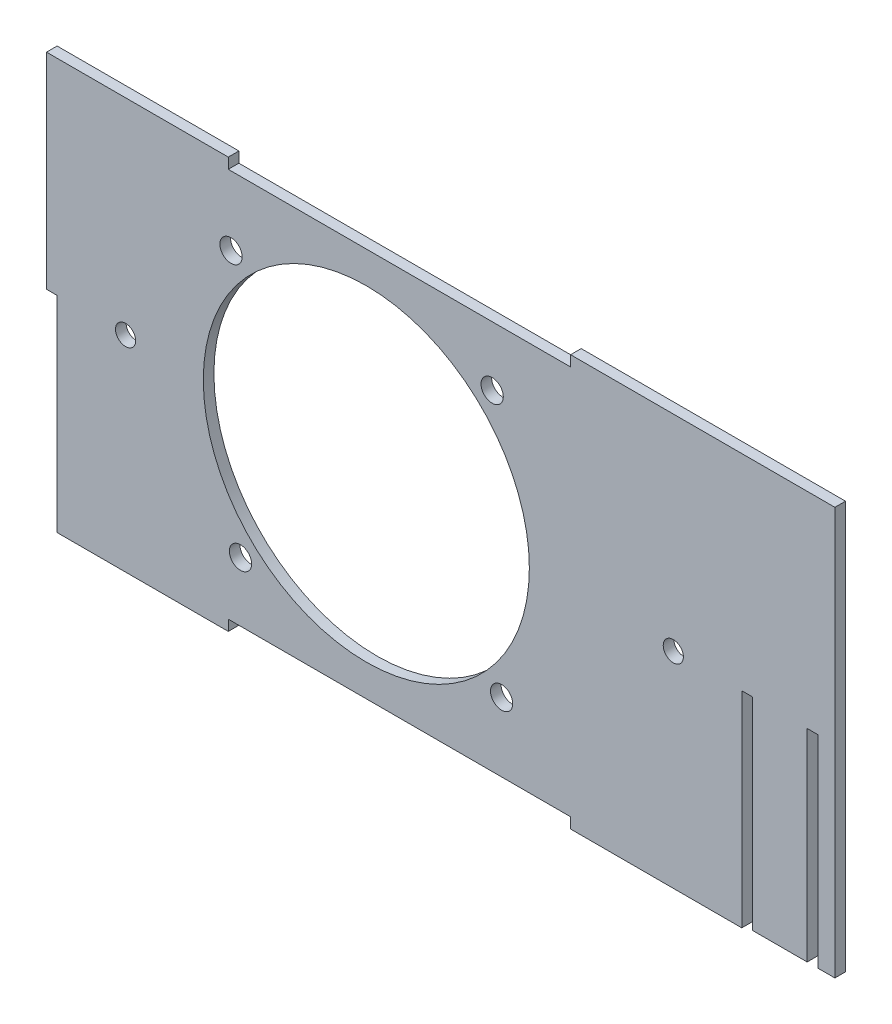
ISO-10303-21;
HEADER;
FILE_DESCRIPTION(('STEP AP214'),'2;1');
FILE_NAME('part.step','',(''),(''),'','','');
FILE_SCHEMA(('AUTOMOTIVE_DESIGN { 1 0 10303 214 1 1 1 1 }'));
ENDSEC;
DATA;
#1=APPLICATION_CONTEXT('core data for automotive mechanical design processes');
#2=APPLICATION_PROTOCOL_DEFINITION('international standard','automotive_design',2000,#1);
#3=PRODUCT_CONTEXT('',#1,'mechanical');
#4=PRODUCT('Part','Part','',(#3));
#5=PRODUCT_RELATED_PRODUCT_CATEGORY('part','',(#4));
#6=PRODUCT_DEFINITION_FORMATION('','',#4);
#7=PRODUCT_DEFINITION_CONTEXT('part definition',#1,'design');
#8=PRODUCT_DEFINITION('design','',#6,#7);
#9=PRODUCT_DEFINITION_SHAPE('','',#8);
#10=(LENGTH_UNIT() NAMED_UNIT(*) SI_UNIT(.MILLI.,.METRE.));
#11=(NAMED_UNIT(*) PLANE_ANGLE_UNIT() SI_UNIT($,.RADIAN.));
#12=(NAMED_UNIT(*) SI_UNIT($,.STERADIAN.) SOLID_ANGLE_UNIT());
#13=UNCERTAINTY_MEASURE_WITH_UNIT(LENGTH_MEASURE(1.E-05),#10,'distance_accuracy_value','');
#14=(GEOMETRIC_REPRESENTATION_CONTEXT(3) GLOBAL_UNCERTAINTY_ASSIGNED_CONTEXT((#13)) GLOBAL_UNIT_ASSIGNED_CONTEXT((#10,
#11,#12)) REPRESENTATION_CONTEXT('',''));
#15=CARTESIAN_POINT('',(0.,0.,0.));
#16=DIRECTION('',(0.,0.,1.));
#17=DIRECTION('',(1.,0.,0.));
#18=AXIS2_PLACEMENT_3D('',#15,#16,#17);
#19=CARTESIAN_POINT('',(109.675,60.,3.1));
#20=DIRECTION('',(0.,-1.,0.));
#21=DIRECTION('',(1.,0.,0.));
#22=AXIS2_PLACEMENT_3D('',#19,#20,#21);
#23=PLANE('',#22);
#24=DIRECTION('',(-1.,0.,0.));
#25=VECTOR('',#24,1.);
#26=CARTESIAN_POINT('',(109.675,60.,3.1));
#27=LINE('',#26,#25);
#28=CARTESIAN_POINT('',(-40.3250000000002,59.9999999999998,3.1));
#29=VERTEX_POINT('',#28);
#30=CARTESIAN_POINT('',(-93.425,60.,3.1));
#31=VERTEX_POINT('',#30);
#32=EDGE_CURVE('E327',#29,#31,#27,.T.);
#33=ORIENTED_EDGE('',*,*,#32,.F.);
#34=DIRECTION('',(0.,0.,-1.));
#35=VECTOR('',#34,1.);
#36=CARTESIAN_POINT('',(-40.3250000000003,60.,3.1));
#37=LINE('',#36,#35);
#38=CARTESIAN_POINT('',(-40.3250000000002,59.9999999999998,0.));
#39=VERTEX_POINT('',#38);
#40=EDGE_CURVE('E41',#29,#39,#37,.T.);
#41=ORIENTED_EDGE('',*,*,#40,.T.);
#42=DIRECTION('',(-1.,0.,0.));
#43=VECTOR('',#42,1.);
#44=CARTESIAN_POINT('',(109.675,60.,0.));
#45=LINE('',#44,#43);
#46=CARTESIAN_POINT('',(-93.425,60.,0.));
#47=VERTEX_POINT('',#46);
#48=EDGE_CURVE('E325',#39,#47,#45,.T.);
#49=ORIENTED_EDGE('',*,*,#48,.T.);
#50=DIRECTION('',(0.,0.,1.));
#51=VECTOR('',#50,1.);
#52=CARTESIAN_POINT('',(-93.425,60.,0.));
#53=LINE('',#52,#51);
#54=EDGE_CURVE('E433',#47,#31,#53,.T.);
#55=ORIENTED_EDGE('',*,*,#54,.T.);
#56=EDGE_LOOP('',(#33,#41,#49,#55));
#57=FACE_BOUND('',#56,.T.);
#58=ADVANCED_FACE('F32',(#57),#23,.F.);
#59=CARTESIAN_POINT('',(109.675,-60.,3.1));
#60=DIRECTION('',(0.,1.,0.));
#61=DIRECTION('',(-1.,0.,0.));
#62=AXIS2_PLACEMENT_3D('',#59,#60,#61);
#63=PLANE('',#62);
#64=DIRECTION('',(1.,0.,0.));
#65=VECTOR('',#64,1.);
#66=CARTESIAN_POINT('',(109.675,-60.,3.1));
#67=LINE('',#66,#65);
#68=CARTESIAN_POINT('',(59.675,-60.,3.1));
#69=VERTEX_POINT('',#68);
#70=CARTESIAN_POINT('',(109.675,-60.,3.1));
#71=VERTEX_POINT('',#70);
#72=EDGE_CURVE('E386',#69,#71,#67,.T.);
#73=ORIENTED_EDGE('',*,*,#72,.F.);
#74=DIRECTION('',(0.,0.,-1.));
#75=VECTOR('',#74,1.);
#76=CARTESIAN_POINT('',(59.675,-60.,3.1));
#77=LINE('',#76,#75);
#78=CARTESIAN_POINT('',(59.675,-60.,0.));
#79=VERTEX_POINT('',#78);
#80=EDGE_CURVE('E311',#69,#79,#77,.T.);
#81=ORIENTED_EDGE('',*,*,#80,.T.);
#82=DIRECTION('',(1.,0.,0.));
#83=VECTOR('',#82,1.);
#84=CARTESIAN_POINT('',(109.675,-60.,0.));
#85=LINE('',#84,#83);
#86=CARTESIAN_POINT('',(109.675,-60.,0.));
#87=VERTEX_POINT('',#86);
#88=EDGE_CURVE('E356',#79,#87,#85,.T.);
#89=ORIENTED_EDGE('',*,*,#88,.T.);
#90=DIRECTION('',(0.,0.,-1.));
#91=VECTOR('',#90,1.);
#92=CARTESIAN_POINT('',(109.675,-60.,3.1));
#93=LINE('',#92,#91);
#94=EDGE_CURVE('E347',#71,#87,#93,.T.);
#95=ORIENTED_EDGE('',*,*,#94,.F.);
#96=EDGE_LOOP('',(#73,#81,#89,#95));
#97=FACE_BOUND('',#96,.T.);
#98=ADVANCED_FACE('F370',(#97),#63,.F.);
#99=CARTESIAN_POINT('',(-90.325,-60.,3.1));
#100=DIRECTION('',(1.,0.,0.));
#101=DIRECTION('',(0.,0.,-1.));
#102=AXIS2_PLACEMENT_3D('',#99,#100,#101);
#103=PLANE('',#102);
#104=DIRECTION('',(0.,0.,1.));
#105=VECTOR('',#104,1.);
#106=CARTESIAN_POINT('',(-90.325,0.,0.));
#107=LINE('',#106,#105);
#108=CARTESIAN_POINT('',(-90.325,0.,0.));
#109=VERTEX_POINT('',#108);
#110=CARTESIAN_POINT('',(-90.325,0.,3.1));
#111=VERTEX_POINT('',#110);
#112=EDGE_CURVE('E435',#109,#111,#107,.T.);
#113=ORIENTED_EDGE('',*,*,#112,.F.);
#114=DIRECTION('',(0.,-1.,0.));
#115=VECTOR('',#114,1.);
#116=CARTESIAN_POINT('',(-90.325,-60.,0.));
#117=LINE('',#116,#115);
#118=CARTESIAN_POINT('',(-90.325,-60.,0.));
#119=VERTEX_POINT('',#118);
#120=EDGE_CURVE('E353',#109,#119,#117,.T.);
#121=ORIENTED_EDGE('',*,*,#120,.T.);
#122=DIRECTION('',(0.,0.,-1.));
#123=VECTOR('',#122,1.);
#124=CARTESIAN_POINT('',(-90.325,-60.,3.1));
#125=LINE('',#124,#123);
#126=CARTESIAN_POINT('',(-90.325,-60.,3.1));
#127=VERTEX_POINT('',#126);
#128=EDGE_CURVE('E312',#127,#119,#125,.T.);
#129=ORIENTED_EDGE('',*,*,#128,.F.);
#130=DIRECTION('',(0.,-1.,0.));
#131=VECTOR('',#130,1.);
#132=CARTESIAN_POINT('',(-90.325,-60.,3.1));
#133=LINE('',#132,#131);
#134=EDGE_CURVE('E339',#111,#127,#133,.T.);
#135=ORIENTED_EDGE('',*,*,#134,.F.);
#136=EDGE_LOOP('',(#113,#121,#129,#135));
#137=FACE_BOUND('',#136,.T.);
#138=ADVANCED_FACE('F34',(#137),#103,.F.);
#139=CARTESIAN_POINT('',(0.,0.,3.1));
#140=DIRECTION('',(0.,0.,1.));
#141=DIRECTION('',(1.,0.,0.));
#142=AXIS2_PLACEMENT_3D('',#139,#140,#141);
#143=PLANE('',#142);
#144=DIRECTION('',(0.,-1.,0.));
#145=VECTOR('',#144,1.);
#146=CARTESIAN_POINT('',(-40.3250000000002,56.8999999999998,3.1));
#147=LINE('',#146,#145);
#148=CARTESIAN_POINT('',(-40.3250000000002,56.8999999999998,3.1));
#149=VERTEX_POINT('',#148);
#150=EDGE_CURVE('E242',#29,#149,#147,.T.);
#151=ORIENTED_EDGE('',*,*,#150,.F.);
#152=ORIENTED_EDGE('',*,*,#32,.T.);
#153=DIRECTION('',(0.,-1.,0.));
#154=VECTOR('',#153,1.);
#155=CARTESIAN_POINT('',(-93.425,0.,3.1));
#156=LINE('',#155,#154);
#157=CARTESIAN_POINT('',(-93.425,0.,3.1));
#158=VERTEX_POINT('',#157);
#159=EDGE_CURVE('E300',#31,#158,#156,.T.);
#160=ORIENTED_EDGE('',*,*,#159,.T.);
#161=DIRECTION('',(1.,0.,0.));
#162=VECTOR('',#161,1.);
#163=CARTESIAN_POINT('',(-90.325,0.,3.1));
#164=LINE('',#163,#162);
#165=EDGE_CURVE('E293',#158,#111,#164,.T.);
#166=ORIENTED_EDGE('',*,*,#165,.T.);
#167=ORIENTED_EDGE('',*,*,#134,.T.);
#168=CARTESIAN_POINT('',(-40.325,-60.,3.1));
#169=VERTEX_POINT('',#168);
#170=EDGE_CURVE('E381',#127,#169,#67,.T.);
#171=ORIENTED_EDGE('',*,*,#170,.T.);
#172=DIRECTION('',(0.,-1.,0.));
#173=VECTOR('',#172,1.);
#174=CARTESIAN_POINT('',(-40.325,-56.9,3.1));
#175=LINE('',#174,#173);
#176=CARTESIAN_POINT('',(-40.325,-56.9,3.1));
#177=VERTEX_POINT('',#176);
#178=EDGE_CURVE('E57',#177,#169,#175,.T.);
#179=ORIENTED_EDGE('',*,*,#178,.F.);
#180=DIRECTION('',(-1.,0.,0.));
#181=VECTOR('',#180,1.);
#182=CARTESIAN_POINT('',(-40.325,-56.9,3.1));
#183=LINE('',#182,#181);
#184=CARTESIAN_POINT('',(59.675,-56.9,3.1));
#185=VERTEX_POINT('',#184);
#186=EDGE_CURVE('E263',#185,#177,#183,.T.);
#187=ORIENTED_EDGE('',*,*,#186,.F.);
#188=DIRECTION('',(0.,1.,0.));
#189=VECTOR('',#188,1.);
#190=CARTESIAN_POINT('',(59.675,-56.9,3.1));
#191=LINE('',#190,#189);
#192=EDGE_CURVE('E260',#69,#185,#191,.T.);
#193=ORIENTED_EDGE('',*,*,#192,.F.);
#194=ORIENTED_EDGE('',*,*,#72,.T.);
#195=DIRECTION('',(0.,1.,0.));
#196=VECTOR('',#195,1.);
#197=CARTESIAN_POINT('',(109.675,-60.,3.1));
#198=LINE('',#197,#196);
#199=CARTESIAN_POINT('',(109.675,0.,3.1));
#200=VERTEX_POINT('',#199);
#201=EDGE_CURVE('E373',#71,#200,#198,.T.);
#202=ORIENTED_EDGE('',*,*,#201,.T.);
#203=DIRECTION('',(1.,0.,0.));
#204=VECTOR('',#203,1.);
#205=CARTESIAN_POINT('',(109.675,0.,3.1));
#206=LINE('',#205,#204);
#207=CARTESIAN_POINT('',(112.775,0.,3.1));
#208=VERTEX_POINT('',#207);
#209=EDGE_CURVE('E277',#200,#208,#206,.T.);
#210=ORIENTED_EDGE('',*,*,#209,.T.);
#211=DIRECTION('',(0.,-1.,0.));
#212=VECTOR('',#211,1.);
#213=CARTESIAN_POINT('',(112.775,0.,3.1));
#214=LINE('',#213,#212);
#215=CARTESIAN_POINT('',(112.775,-59.0807240954792,3.1));
#216=VERTEX_POINT('',#215);
#217=EDGE_CURVE('E234',#208,#216,#214,.T.);
#218=ORIENTED_EDGE('',*,*,#217,.T.);
#219=DIRECTION('',(1.,0.,0.));
#220=VECTOR('',#219,1.);
#221=CARTESIAN_POINT('',(112.775,-59.0807240954792,3.1));
#222=LINE('',#221,#220);
#223=CARTESIAN_POINT('',(128.775,-59.0807240954792,3.1));
#224=VERTEX_POINT('',#223);
#225=EDGE_CURVE('E206',#216,#224,#222,.T.);
#226=ORIENTED_EDGE('',*,*,#225,.T.);
#227=DIRECTION('',(0.,1.,0.));
#228=VECTOR('',#227,1.);
#229=CARTESIAN_POINT('',(128.775,-59.0807240954792,3.1));
#230=LINE('',#229,#228);
#231=CARTESIAN_POINT('',(128.775,0.,3.1));
#232=VERTEX_POINT('',#231);
#233=EDGE_CURVE('E726',#224,#232,#230,.T.);
#234=ORIENTED_EDGE('',*,*,#233,.T.);
#235=DIRECTION('',(1.,0.,0.));
#236=VECTOR('',#235,1.);
#237=CARTESIAN_POINT('',(128.775,0.,3.1));
#238=LINE('',#237,#236);
#239=CARTESIAN_POINT('',(131.875,0.,3.1));
#240=VERTEX_POINT('',#239);
#241=EDGE_CURVE('E730',#232,#240,#238,.T.);
#242=ORIENTED_EDGE('',*,*,#241,.T.);
#243=DIRECTION('',(0.,-1.,0.));
#244=VECTOR('',#243,1.);
#245=CARTESIAN_POINT('',(131.875,0.,3.1));
#246=LINE('',#245,#244);
#247=CARTESIAN_POINT('',(131.875,-59.0807240954792,3.1));
#248=VERTEX_POINT('',#247);
#249=EDGE_CURVE('E731',#240,#248,#246,.T.);
#250=ORIENTED_EDGE('',*,*,#249,.T.);
#251=DIRECTION('',(1.,0.,0.));
#252=VECTOR('',#251,1.);
#253=CARTESIAN_POINT('',(131.875,-59.0807240954792,3.1));
#254=LINE('',#253,#252);
#255=CARTESIAN_POINT('',(136.875,-59.0807240954792,3.1));
#256=VERTEX_POINT('',#255);
#257=EDGE_CURVE('E736',#248,#256,#254,.T.);
#258=ORIENTED_EDGE('',*,*,#257,.T.);
#259=DIRECTION('',(0.,1.,0.));
#260=VECTOR('',#259,1.);
#261=CARTESIAN_POINT('',(136.875,-59.0807240954792,3.1));
#262=LINE('',#261,#260);
#263=CARTESIAN_POINT('',(136.875,60.,3.1));
#264=VERTEX_POINT('',#263);
#265=EDGE_CURVE('E200',#256,#264,#262,.T.);
#266=ORIENTED_EDGE('',*,*,#265,.T.);
#267=CARTESIAN_POINT('',(59.6749999999998,60.,3.1));
#268=VERTEX_POINT('',#267);
#269=EDGE_CURVE('E350',#264,#268,#27,.T.);
#270=ORIENTED_EDGE('',*,*,#269,.T.);
#271=DIRECTION('',(0.,1.,0.));
#272=VECTOR('',#271,1.);
#273=CARTESIAN_POINT('',(59.6749999999998,56.9000000000002,3.1));
#274=LINE('',#273,#272);
#275=CARTESIAN_POINT('',(59.6749999999998,56.9000000000002,3.1));
#276=VERTEX_POINT('',#275);
#277=EDGE_CURVE('E49',#276,#268,#274,.T.);
#278=ORIENTED_EDGE('',*,*,#277,.F.);
#279=DIRECTION('',(1.,0.,0.));
#280=VECTOR('',#279,1.);
#281=CARTESIAN_POINT('',(-40.3250000000002,56.8999999999998,3.1));
#282=LINE('',#281,#280);
#283=EDGE_CURVE('E245',#149,#276,#282,.T.);
#284=ORIENTED_EDGE('',*,*,#283,.F.);
#285=EDGE_LOOP('',(#151,#152,#160,#166,#167,#171,#179,#187,#193,#194,#202,#210,#218,#226,#234,
#242,#250,#258,#266,#270,#278,#284));
#286=FACE_BOUND('',#285,.T.);
#287=CARTESIAN_POINT('',(-70.325,0.,3.1));
#288=DIRECTION('',(0.,0.,1.));
#289=DIRECTION('',(1.,0.,0.));
#290=AXIS2_PLACEMENT_3D('',#287,#288,#289);
#291=CIRCLE('',#290,2.94564370306994);
#292=CARTESIAN_POINT('',(-67.3793562969301,0.,3.1));
#293=VERTEX_POINT('',#292);
#294=EDGE_CURVE('E416',#293,#293,#291,.T.);
#295=ORIENTED_EDGE('',*,*,#294,.F.);
#296=EDGE_LOOP('',(#295));
#297=FACE_BOUND('',#296,.T.);
#298=CARTESIAN_POINT('',(39.5221967893411,-36.7599862070785,3.1));
#299=DIRECTION('',(0.,0.,1.));
#300=DIRECTION('',(1.,0.,0.));
#301=AXIS2_PLACEMENT_3D('',#298,#299,#300);
#302=CIRCLE('',#301,3.25);
#303=CARTESIAN_POINT('',(42.7721967893411,-36.7599862070785,3.1));
#304=VERTEX_POINT('',#303);
#305=EDGE_CURVE('E404',#304,#304,#302,.T.);
#306=ORIENTED_EDGE('',*,*,#305,.F.);
#307=EDGE_LOOP('',(#306));
#308=FACE_BOUND('',#307,.T.);
#309=CARTESIAN_POINT('',(0.,0.,3.1));
#310=DIRECTION('',(0.,0.,1.));
#311=DIRECTION('',(1.,0.,0.));
#312=AXIS2_PLACEMENT_3D('',#309,#310,#311);
#313=CIRCLE('',#312,47.625);
#314=CARTESIAN_POINT('',(47.625,0.,3.1));
#315=VERTEX_POINT('',#314);
#316=EDGE_CURVE('E392',#315,#315,#313,.T.);
#317=ORIENTED_EDGE('',*,*,#316,.F.);
#318=EDGE_LOOP('',(#317));
#319=FACE_BOUND('',#318,.T.);
#320=CARTESIAN_POINT('',(-39.5221967893411,36.7599862070785,3.1));
#321=DIRECTION('',(0.,0.,1.));
#322=DIRECTION('',(1.,0.,0.));
#323=AXIS2_PLACEMENT_3D('',#320,#321,#322);
#324=CIRCLE('',#323,3.24999999999999);
#325=CARTESIAN_POINT('',(-36.2721967893411,36.7599862070785,3.1));
#326=VERTEX_POINT('',#325);
#327=EDGE_CURVE('E357',#326,#326,#324,.T.);
#328=ORIENTED_EDGE('',*,*,#327,.F.);
#329=EDGE_LOOP('',(#328));
#330=FACE_BOUND('',#329,.T.);
#331=CARTESIAN_POINT('',(36.7599862070784,39.5221967893411,3.1));
#332=DIRECTION('',(0.,0.,1.));
#333=DIRECTION('',(1.,0.,0.));
#334=AXIS2_PLACEMENT_3D('',#331,#332,#333);
#335=CIRCLE('',#334,3.25);
#336=CARTESIAN_POINT('',(40.0099862070784,39.5221967893411,3.1));
#337=VERTEX_POINT('',#336);
#338=EDGE_CURVE('E398',#337,#337,#335,.T.);
#339=ORIENTED_EDGE('',*,*,#338,.F.);
#340=EDGE_LOOP('',(#339));
#341=FACE_BOUND('',#340,.T.);
#342=CARTESIAN_POINT('',(-36.7599862070784,-39.5221967893411,3.1));
#343=DIRECTION('',(0.,0.,1.));
#344=DIRECTION('',(1.,0.,0.));
#345=AXIS2_PLACEMENT_3D('',#342,#343,#344);
#346=CIRCLE('',#345,3.25);
#347=CARTESIAN_POINT('',(-33.5099862070784,-39.5221967893411,3.1));
#348=VERTEX_POINT('',#347);
#349=EDGE_CURVE('E410',#348,#348,#346,.T.);
#350=ORIENTED_EDGE('',*,*,#349,.F.);
#351=EDGE_LOOP('',(#350));
#352=FACE_BOUND('',#351,.T.);
#353=CARTESIAN_POINT('',(89.675,0.,3.1));
#354=DIRECTION('',(0.,0.,1.));
#355=DIRECTION('',(-1.,0.,0.));
#356=AXIS2_PLACEMENT_3D('',#353,#354,#355);
#357=CIRCLE('',#356,2.94564370306994);
#358=CARTESIAN_POINT('',(86.7293562969301,0.,3.1));
#359=VERTEX_POINT('',#358);
#360=EDGE_CURVE('E422',#359,#359,#357,.T.);
#361=ORIENTED_EDGE('',*,*,#360,.F.);
#362=EDGE_LOOP('',(#361));
#363=FACE_BOUND('',#362,.T.);
#364=ADVANCED_FACE('F377',(#286,#297,#308,#319,#330,#341,#352,#363),#143,.T.);
#365=CARTESIAN_POINT('',(0.,0.,0.));
#366=DIRECTION('',(0.,0.,1.));
#367=DIRECTION('',(1.,0.,0.));
#368=AXIS2_PLACEMENT_3D('',#365,#366,#367);
#369=PLANE('',#368);
#370=ORIENTED_EDGE('',*,*,#48,.F.);
#371=DIRECTION('',(0.,-1.,0.));
#372=VECTOR('',#371,1.);
#373=CARTESIAN_POINT('',(-40.325,-1.80523159145199E-13,0.));
#374=LINE('',#373,#372);
#375=CARTESIAN_POINT('',(-40.3250000000002,56.8999999999998,0.));
#376=VERTEX_POINT('',#375);
#377=EDGE_CURVE('E257',#39,#376,#374,.T.);
#378=ORIENTED_EDGE('',*,*,#377,.T.);
#379=DIRECTION('',(1.,0.,0.));
#380=VECTOR('',#379,1.);
#381=CARTESIAN_POINT('',(-2.52686760404685E-13,56.9,0.));
#382=LINE('',#381,#380);
#383=CARTESIAN_POINT('',(59.6749999999998,56.9000000000002,0.));
#384=VERTEX_POINT('',#383);
#385=EDGE_CURVE('E11',#376,#384,#382,.T.);
#386=ORIENTED_EDGE('',*,*,#385,.T.);
#387=DIRECTION('',(0.,1.,0.));
#388=VECTOR('',#387,1.);
#389=CARTESIAN_POINT('',(59.675,2.67147415300429E-13,0.));
#390=LINE('',#389,#388);
#391=CARTESIAN_POINT('',(59.6749999999998,60.0000000000002,0.));
#392=VERTEX_POINT('',#391);
#393=EDGE_CURVE('E253',#384,#392,#390,.T.);
#394=ORIENTED_EDGE('',*,*,#393,.T.);
#395=CARTESIAN_POINT('',(112.775,60.,-2.5E-06));
#396=VERTEX_POINT('',#395);
#397=EDGE_CURVE('E286',#396,#392,#45,.T.);
#398=ORIENTED_EDGE('',*,*,#397,.F.);
#399=DIRECTION('',(0.,1.,0.));
#400=VECTOR('',#399,1.);
#401=CARTESIAN_POINT('',(112.775,0.,0.));
#402=LINE('',#401,#400);
#403=CARTESIAN_POINT('',(112.775,0.,0.));
#404=VERTEX_POINT('',#403);
#405=EDGE_CURVE('E194',#404,#396,#402,.T.);
#406=ORIENTED_EDGE('',*,*,#405,.F.);
#407=DIRECTION('',(1.,0.,0.));
#408=VECTOR('',#407,1.);
#409=CARTESIAN_POINT('',(109.675,0.,0.));
#410=LINE('',#409,#408);
#411=CARTESIAN_POINT('',(109.675,0.,0.));
#412=VERTEX_POINT('',#411);
#413=EDGE_CURVE('E285',#412,#404,#410,.T.);
#414=ORIENTED_EDGE('',*,*,#413,.F.);
#415=DIRECTION('',(0.,1.,0.));
#416=VECTOR('',#415,1.);
#417=CARTESIAN_POINT('',(109.675,-60.,0.));
#418=LINE('',#417,#416);
#419=EDGE_CURVE('E337',#87,#412,#418,.T.);
#420=ORIENTED_EDGE('',*,*,#419,.F.);
#421=ORIENTED_EDGE('',*,*,#88,.F.);
#422=DIRECTION('',(0.,1.,0.));
#423=VECTOR('',#422,1.);
#424=CARTESIAN_POINT('',(59.675,0.,0.));
#425=LINE('',#424,#423);
#426=CARTESIAN_POINT('',(59.675,-56.9,0.));
#427=VERTEX_POINT('',#426);
#428=EDGE_CURVE('E274',#79,#427,#425,.T.);
#429=ORIENTED_EDGE('',*,*,#428,.T.);
#430=DIRECTION('',(-1.,0.,0.));
#431=VECTOR('',#430,1.);
#432=CARTESIAN_POINT('',(0.,-56.9,0.));
#433=LINE('',#432,#431);
#434=CARTESIAN_POINT('',(-40.325,-56.9,0.));
#435=VERTEX_POINT('',#434);
#436=EDGE_CURVE('E315',#427,#435,#433,.T.);
#437=ORIENTED_EDGE('',*,*,#436,.T.);
#438=DIRECTION('',(0.,-1.,0.));
#439=VECTOR('',#438,1.);
#440=CARTESIAN_POINT('',(-40.325,0.,0.));
#441=LINE('',#440,#439);
#442=CARTESIAN_POINT('',(-40.325,-60.,0.));
#443=VERTEX_POINT('',#442);
#444=EDGE_CURVE('E270',#435,#443,#441,.T.);
#445=ORIENTED_EDGE('',*,*,#444,.T.);
#446=EDGE_CURVE('E340',#119,#443,#85,.T.);
#447=ORIENTED_EDGE('',*,*,#446,.F.);
#448=ORIENTED_EDGE('',*,*,#120,.F.);
#449=DIRECTION('',(1.,0.,0.));
#450=VECTOR('',#449,1.);
#451=CARTESIAN_POINT('',(-90.325,0.,0.));
#452=LINE('',#451,#450);
#453=CARTESIAN_POINT('',(-93.425,0.,0.));
#454=VERTEX_POINT('',#453);
#455=EDGE_CURVE('E440',#454,#109,#452,.T.);
#456=ORIENTED_EDGE('',*,*,#455,.F.);
#457=DIRECTION('',(0.,-1.,0.));
#458=VECTOR('',#457,1.);
#459=CARTESIAN_POINT('',(-93.425,0.,0.));
#460=LINE('',#459,#458);
#461=EDGE_CURVE('E336',#47,#454,#460,.T.);
#462=ORIENTED_EDGE('',*,*,#461,.F.);
#463=EDGE_LOOP('',(#370,#378,#386,#394,#398,#406,#414,#420,#421,#429,#437,#445,#447,#448,#456,#462));
#464=FACE_BOUND('',#463,.T.);
#465=CARTESIAN_POINT('',(-70.325,0.,0.));
#466=DIRECTION('',(0.,0.,1.));
#467=DIRECTION('',(1.,0.,0.));
#468=AXIS2_PLACEMENT_3D('',#465,#466,#467);
#469=CIRCLE('',#468,2.94564370306994);
#470=CARTESIAN_POINT('',(-67.3793562969301,0.,0.));
#471=VERTEX_POINT('',#470);
#472=EDGE_CURVE('E419',#471,#471,#469,.T.);
#473=ORIENTED_EDGE('',*,*,#472,.T.);
#474=EDGE_LOOP('',(#473));
#475=FACE_BOUND('',#474,.T.);
#476=CARTESIAN_POINT('',(39.5221967893411,-36.7599862070785,0.));
#477=DIRECTION('',(0.,0.,1.));
#478=DIRECTION('',(1.,0.,0.));
#479=AXIS2_PLACEMENT_3D('',#476,#477,#478);
#480=CIRCLE('',#479,3.25);
#481=CARTESIAN_POINT('',(42.7721967893411,-36.7599862070785,0.));
#482=VERTEX_POINT('',#481);
#483=EDGE_CURVE('E407',#482,#482,#480,.T.);
#484=ORIENTED_EDGE('',*,*,#483,.T.);
#485=EDGE_LOOP('',(#484));
#486=FACE_BOUND('',#485,.T.);
#487=CARTESIAN_POINT('',(0.,0.,0.));
#488=DIRECTION('',(0.,0.,1.));
#489=DIRECTION('',(1.,0.,0.));
#490=AXIS2_PLACEMENT_3D('',#487,#488,#489);
#491=CIRCLE('',#490,47.625);
#492=CARTESIAN_POINT('',(47.625,0.,0.));
#493=VERTEX_POINT('',#492);
#494=EDGE_CURVE('E395',#493,#493,#491,.T.);
#495=ORIENTED_EDGE('',*,*,#494,.T.);
#496=EDGE_LOOP('',(#495));
#497=FACE_BOUND('',#496,.T.);
#498=CARTESIAN_POINT('',(-39.5221967893411,36.7599862070785,0.));
#499=DIRECTION('',(0.,0.,1.));
#500=DIRECTION('',(1.,0.,0.));
#501=AXIS2_PLACEMENT_3D('',#498,#499,#500);
#502=CIRCLE('',#501,3.24999999999999);
#503=CARTESIAN_POINT('',(-36.2721967893411,36.7599862070785,0.));
#504=VERTEX_POINT('',#503);
#505=EDGE_CURVE('E389',#504,#504,#502,.T.);
#506=ORIENTED_EDGE('',*,*,#505,.T.);
#507=EDGE_LOOP('',(#506));
#508=FACE_BOUND('',#507,.T.);
#509=CARTESIAN_POINT('',(36.7599862070784,39.5221967893411,0.));
#510=DIRECTION('',(0.,0.,1.));
#511=DIRECTION('',(1.,0.,0.));
#512=AXIS2_PLACEMENT_3D('',#509,#510,#511);
#513=CIRCLE('',#512,3.25);
#514=CARTESIAN_POINT('',(40.0099862070784,39.5221967893411,0.));
#515=VERTEX_POINT('',#514);
#516=EDGE_CURVE('E401',#515,#515,#513,.T.);
#517=ORIENTED_EDGE('',*,*,#516,.T.);
#518=EDGE_LOOP('',(#517));
#519=FACE_BOUND('',#518,.T.);
#520=CARTESIAN_POINT('',(-36.7599862070784,-39.5221967893411,0.));
#521=DIRECTION('',(0.,0.,1.));
#522=DIRECTION('',(1.,0.,0.));
#523=AXIS2_PLACEMENT_3D('',#520,#521,#522);
#524=CIRCLE('',#523,3.25);
#525=CARTESIAN_POINT('',(-33.5099862070784,-39.5221967893411,0.));
#526=VERTEX_POINT('',#525);
#527=EDGE_CURVE('E413',#526,#526,#524,.T.);
#528=ORIENTED_EDGE('',*,*,#527,.T.);
#529=EDGE_LOOP('',(#528));
#530=FACE_BOUND('',#529,.T.);
#531=CARTESIAN_POINT('',(89.675,0.,0.));
#532=DIRECTION('',(0.,0.,1.));
#533=DIRECTION('',(-1.,0.,0.));
#534=AXIS2_PLACEMENT_3D('',#531,#532,#533);
#535=CIRCLE('',#534,2.94564370306994);
#536=CARTESIAN_POINT('',(86.7293562969301,0.,0.));
#537=VERTEX_POINT('',#536);
#538=EDGE_CURVE('E425',#537,#537,#535,.T.);
#539=ORIENTED_EDGE('',*,*,#538,.T.);
#540=EDGE_LOOP('',(#539));
#541=FACE_BOUND('',#540,.T.);
#542=ADVANCED_FACE('F332',(#464,#475,#486,#497,#508,#519,#530,#541),#369,.F.);
#543=ORIENTED_EDGE('',*,*,#446,.T.);
#544=DIRECTION('',(0.,0.,1.));
#545=VECTOR('',#544,1.);
#546=CARTESIAN_POINT('',(-40.325,-60.,3.1));
#547=LINE('',#546,#545);
#548=EDGE_CURVE('E309',#443,#169,#547,.T.);
#549=ORIENTED_EDGE('',*,*,#548,.T.);
#550=ORIENTED_EDGE('',*,*,#170,.F.);
#551=ORIENTED_EDGE('',*,*,#128,.T.);
#552=EDGE_LOOP('',(#543,#549,#550,#551));
#553=FACE_BOUND('',#552,.T.);
#554=ADVANCED_FACE('F467',(#553),#63,.F.);
#555=CARTESIAN_POINT('',(109.675,-60.,3.1));
#556=DIRECTION('',(-1.,0.,0.));
#557=DIRECTION('',(0.,0.,1.));
#558=AXIS2_PLACEMENT_3D('',#555,#556,#557);
#559=PLANE('',#558);
#560=ORIENTED_EDGE('',*,*,#419,.T.);
#561=DIRECTION('',(0.,0.,1.));
#562=VECTOR('',#561,1.);
#563=CARTESIAN_POINT('',(109.675,0.,0.));
#564=LINE('',#563,#562);
#565=EDGE_CURVE('E288',#412,#200,#564,.T.);
#566=ORIENTED_EDGE('',*,*,#565,.T.);
#567=ORIENTED_EDGE('',*,*,#201,.F.);
#568=ORIENTED_EDGE('',*,*,#94,.T.);
#569=EDGE_LOOP('',(#560,#566,#567,#568));
#570=FACE_BOUND('',#569,.T.);
#571=ADVANCED_FACE('F372',(#570),#559,.F.);
#572=ORIENTED_EDGE('',*,*,#397,.T.);
#573=DIRECTION('',(0.,0.,1.));
#574=VECTOR('',#573,1.);
#575=CARTESIAN_POINT('',(59.6749999999998,60.,3.1));
#576=LINE('',#575,#574);
#577=EDGE_CURVE('E318',#392,#268,#576,.T.);
#578=ORIENTED_EDGE('',*,*,#577,.T.);
#579=ORIENTED_EDGE('',*,*,#269,.F.);
#580=DIRECTION('',(0.,0.,1.));
#581=VECTOR('',#580,1.);
#582=CARTESIAN_POINT('',(136.875,60.,-5.00000000001367E-05));
#583=LINE('',#582,#581);
#584=CARTESIAN_POINT('',(136.875,60.,-5.00000000001367E-05));
#585=VERTEX_POINT('',#584);
#586=EDGE_CURVE('E246',#585,#264,#583,.T.);
#587=ORIENTED_EDGE('',*,*,#586,.F.);
#588=DIRECTION('',(-1.,0.,0.));
#589=VECTOR('',#588,1.);
#590=CARTESIAN_POINT('',(136.875,60.,-5.00000000001367E-05));
#591=LINE('',#590,#589);
#592=EDGE_CURVE('E208',#585,#396,#591,.T.);
#593=ORIENTED_EDGE('',*,*,#592,.T.);
#594=EDGE_LOOP('',(#572,#578,#579,#587,#593));
#595=FACE_BOUND('',#594,.T.);
#596=ADVANCED_FACE('F463',(#595),#23,.F.);
#597=CARTESIAN_POINT('',(-39.5221967893411,36.7599862070785,3.1));
#598=DIRECTION('',(0.,0.,-1.));
#599=DIRECTION('',(-1.,0.,0.));
#600=AXIS2_PLACEMENT_3D('',#597,#598,#599);
#601=CYLINDRICAL_SURFACE('',#600,3.24999999999999);
#602=ORIENTED_EDGE('',*,*,#327,.T.);
#603=EDGE_LOOP('',(#602));
#604=FACE_BOUND('',#603,.T.);
#605=ORIENTED_EDGE('',*,*,#505,.F.);
#606=EDGE_LOOP('',(#605));
#607=FACE_BOUND('',#606,.T.);
#608=ADVANCED_FACE('F471',(#604,#607),#601,.F.);
#609=CARTESIAN_POINT('',(0.,0.,3.1));
#610=DIRECTION('',(0.,0.,-1.));
#611=DIRECTION('',(-1.,0.,0.));
#612=AXIS2_PLACEMENT_3D('',#609,#610,#611);
#613=CYLINDRICAL_SURFACE('',#612,47.625);
#614=ORIENTED_EDGE('',*,*,#316,.T.);
#615=EDGE_LOOP('',(#614));
#616=FACE_BOUND('',#615,.T.);
#617=ORIENTED_EDGE('',*,*,#494,.F.);
#618=EDGE_LOOP('',(#617));
#619=FACE_BOUND('',#618,.T.);
#620=ADVANCED_FACE('F477',(#616,#619),#613,.F.);
#621=CARTESIAN_POINT('',(36.7599862070784,39.5221967893411,3.1));
#622=DIRECTION('',(0.,0.,-1.));
#623=DIRECTION('',(-1.,0.,0.));
#624=AXIS2_PLACEMENT_3D('',#621,#622,#623);
#625=CYLINDRICAL_SURFACE('',#624,3.25);
#626=ORIENTED_EDGE('',*,*,#338,.T.);
#627=EDGE_LOOP('',(#626));
#628=FACE_BOUND('',#627,.T.);
#629=ORIENTED_EDGE('',*,*,#516,.F.);
#630=EDGE_LOOP('',(#629));
#631=FACE_BOUND('',#630,.T.);
#632=ADVANCED_FACE('F531',(#628,#631),#625,.F.);
#633=CARTESIAN_POINT('',(39.5221967893411,-36.7599862070785,3.1));
#634=DIRECTION('',(0.,0.,-1.));
#635=DIRECTION('',(-1.,0.,0.));
#636=AXIS2_PLACEMENT_3D('',#633,#634,#635);
#637=CYLINDRICAL_SURFACE('',#636,3.25);
#638=ORIENTED_EDGE('',*,*,#305,.T.);
#639=EDGE_LOOP('',(#638));
#640=FACE_BOUND('',#639,.T.);
#641=ORIENTED_EDGE('',*,*,#483,.F.);
#642=EDGE_LOOP('',(#641));
#643=FACE_BOUND('',#642,.T.);
#644=ADVANCED_FACE('F535',(#640,#643),#637,.F.);
#645=CARTESIAN_POINT('',(-36.7599862070784,-39.5221967893411,3.1));
#646=DIRECTION('',(0.,0.,-1.));
#647=DIRECTION('',(-1.,0.,0.));
#648=AXIS2_PLACEMENT_3D('',#645,#646,#647);
#649=CYLINDRICAL_SURFACE('',#648,3.25);
#650=ORIENTED_EDGE('',*,*,#349,.T.);
#651=EDGE_LOOP('',(#650));
#652=FACE_BOUND('',#651,.T.);
#653=ORIENTED_EDGE('',*,*,#527,.F.);
#654=EDGE_LOOP('',(#653));
#655=FACE_BOUND('',#654,.T.);
#656=ADVANCED_FACE('F539',(#652,#655),#649,.F.);
#657=CARTESIAN_POINT('',(-70.325,0.,3.1));
#658=DIRECTION('',(0.,0.,-1.));
#659=DIRECTION('',(-1.,0.,0.));
#660=AXIS2_PLACEMENT_3D('',#657,#658,#659);
#661=CYLINDRICAL_SURFACE('',#660,2.94564370306994);
#662=ORIENTED_EDGE('',*,*,#294,.T.);
#663=EDGE_LOOP('',(#662));
#664=FACE_BOUND('',#663,.T.);
#665=ORIENTED_EDGE('',*,*,#472,.F.);
#666=EDGE_LOOP('',(#665));
#667=FACE_BOUND('',#666,.T.);
#668=ADVANCED_FACE('F543',(#664,#667),#661,.F.);
#669=CARTESIAN_POINT('',(89.675,0.,3.1));
#670=DIRECTION('',(0.,0.,-1.));
#671=DIRECTION('',(-1.,0.,0.));
#672=AXIS2_PLACEMENT_3D('',#669,#670,#671);
#673=CYLINDRICAL_SURFACE('',#672,2.94564370306994);
#674=ORIENTED_EDGE('',*,*,#360,.T.);
#675=EDGE_LOOP('',(#674));
#676=FACE_BOUND('',#675,.T.);
#677=ORIENTED_EDGE('',*,*,#538,.F.);
#678=EDGE_LOOP('',(#677));
#679=FACE_BOUND('',#678,.T.);
#680=ADVANCED_FACE('F459',(#676,#679),#673,.F.);
#681=CARTESIAN_POINT('',(-90.325,0.,0.));
#682=DIRECTION('',(0.,-1.,0.));
#683=DIRECTION('',(1.,0.,0.));
#684=AXIS2_PLACEMENT_3D('',#681,#682,#683);
#685=PLANE('',#684);
#686=ORIENTED_EDGE('',*,*,#165,.F.);
#687=DIRECTION('',(0.,0.,1.));
#688=VECTOR('',#687,1.);
#689=CARTESIAN_POINT('',(-93.425,0.,0.));
#690=LINE('',#689,#688);
#691=EDGE_CURVE('E428',#454,#158,#690,.T.);
#692=ORIENTED_EDGE('',*,*,#691,.F.);
#693=ORIENTED_EDGE('',*,*,#455,.T.);
#694=ORIENTED_EDGE('',*,*,#112,.T.);
#695=EDGE_LOOP('',(#686,#692,#693,#694));
#696=FACE_BOUND('',#695,.T.);
#697=ADVANCED_FACE('F451',(#696),#685,.T.);
#698=CARTESIAN_POINT('',(-93.425,0.,0.));
#699=DIRECTION('',(-1.,0.,0.));
#700=DIRECTION('',(0.,0.,1.));
#701=AXIS2_PLACEMENT_3D('',#698,#699,#700);
#702=PLANE('',#701);
#703=ORIENTED_EDGE('',*,*,#159,.F.);
#704=ORIENTED_EDGE('',*,*,#54,.F.);
#705=ORIENTED_EDGE('',*,*,#461,.T.);
#706=ORIENTED_EDGE('',*,*,#691,.T.);
#707=EDGE_LOOP('',(#703,#704,#705,#706));
#708=FACE_BOUND('',#707,.T.);
#709=ADVANCED_FACE('F449',(#708),#702,.T.);
#710=CARTESIAN_POINT('',(109.675,0.,0.));
#711=DIRECTION('',(0.,-1.,0.));
#712=DIRECTION('',(1.,0.,0.));
#713=AXIS2_PLACEMENT_3D('',#710,#711,#712);
#714=PLANE('',#713);
#715=ORIENTED_EDGE('',*,*,#209,.F.);
#716=ORIENTED_EDGE('',*,*,#565,.F.);
#717=ORIENTED_EDGE('',*,*,#413,.T.);
#718=DIRECTION('',(0.,0.,1.));
#719=VECTOR('',#718,1.);
#720=CARTESIAN_POINT('',(112.775,0.,0.));
#721=LINE('',#720,#719);
#722=EDGE_CURVE('E284',#404,#208,#721,.T.);
#723=ORIENTED_EDGE('',*,*,#722,.T.);
#724=EDGE_LOOP('',(#715,#716,#717,#723));
#725=FACE_BOUND('',#724,.T.);
#726=ADVANCED_FACE('F375',(#725),#714,.T.);
#727=CARTESIAN_POINT('',(-40.325,-56.9,-5.00000000001367E-05));
#728=DIRECTION('',(0.,1.,0.));
#729=DIRECTION('',(0.,0.,1.));
#730=AXIS2_PLACEMENT_3D('',#727,#728,#729);
#731=PLANE('',#730);
#732=DIRECTION('',(0.,0.,1.));
#733=VECTOR('',#732,1.);
#734=CARTESIAN_POINT('',(59.675,-56.9,-5.00000000001367E-05));
#735=LINE('',#734,#733);
#736=EDGE_CURVE('E267',#427,#185,#735,.T.);
#737=ORIENTED_EDGE('',*,*,#736,.T.);
#738=ORIENTED_EDGE('',*,*,#186,.T.);
#739=DIRECTION('',(0.,0.,1.));
#740=VECTOR('',#739,1.);
#741=CARTESIAN_POINT('',(-40.325,-56.9,-5.00000000001367E-05));
#742=LINE('',#741,#740);
#743=EDGE_CURVE('E268',#435,#177,#742,.T.);
#744=ORIENTED_EDGE('',*,*,#743,.F.);
#745=ORIENTED_EDGE('',*,*,#436,.F.);
#746=EDGE_LOOP('',(#737,#738,#744,#745));
#747=FACE_BOUND('',#746,.T.);
#748=ADVANCED_FACE('F457',(#747),#731,.F.);
#749=CARTESIAN_POINT('',(59.675,-56.9,-5.00000000001367E-05));
#750=DIRECTION('',(1.,0.,0.));
#751=DIRECTION('',(0.,0.,-1.));
#752=AXIS2_PLACEMENT_3D('',#749,#750,#751);
#753=PLANE('',#752);
#754=ORIENTED_EDGE('',*,*,#80,.F.);
#755=ORIENTED_EDGE('',*,*,#192,.T.);
#756=ORIENTED_EDGE('',*,*,#736,.F.);
#757=ORIENTED_EDGE('',*,*,#428,.F.);
#758=EDGE_LOOP('',(#754,#755,#756,#757));
#759=FACE_BOUND('',#758,.T.);
#760=ADVANCED_FACE('F504',(#759),#753,.F.);
#761=CARTESIAN_POINT('',(-40.325,-56.9,-5.00000000001367E-05));
#762=DIRECTION('',(-1.,0.,0.));
#763=DIRECTION('',(0.,0.,1.));
#764=AXIS2_PLACEMENT_3D('',#761,#762,#763);
#765=PLANE('',#764);
#766=ORIENTED_EDGE('',*,*,#743,.T.);
#767=ORIENTED_EDGE('',*,*,#178,.T.);
#768=ORIENTED_EDGE('',*,*,#548,.F.);
#769=ORIENTED_EDGE('',*,*,#444,.F.);
#770=EDGE_LOOP('',(#766,#767,#768,#769));
#771=FACE_BOUND('',#770,.T.);
#772=ADVANCED_FACE('F499',(#771),#765,.F.);
#773=CARTESIAN_POINT('',(-40.3250000000002,56.8999999999998,-5.00000000001367E-05));
#774=DIRECTION('',(0.,-1.,0.));
#775=DIRECTION('',(1.,0.,0.));
#776=AXIS2_PLACEMENT_3D('',#773,#774,#775);
#777=PLANE('',#776);
#778=DIRECTION('',(0.,0.,1.));
#779=VECTOR('',#778,1.);
#780=CARTESIAN_POINT('',(-40.3250000000002,56.8999999999998,-5.00000000001367E-05));
#781=LINE('',#780,#779);
#782=EDGE_CURVE('E250',#376,#149,#781,.T.);
#783=ORIENTED_EDGE('',*,*,#782,.T.);
#784=ORIENTED_EDGE('',*,*,#283,.T.);
#785=DIRECTION('',(0.,0.,1.));
#786=VECTOR('',#785,1.);
#787=CARTESIAN_POINT('',(59.6749999999998,56.9000000000002,-5.00000000001367E-05));
#788=LINE('',#787,#786);
#789=EDGE_CURVE('E251',#384,#276,#788,.T.);
#790=ORIENTED_EDGE('',*,*,#789,.F.);
#791=ORIENTED_EDGE('',*,*,#385,.F.);
#792=EDGE_LOOP('',(#783,#784,#790,#791));
#793=FACE_BOUND('',#792,.T.);
#794=ADVANCED_FACE('F484',(#793),#777,.F.);
#795=CARTESIAN_POINT('',(-40.3250000000002,56.8999999999998,-5.00000000001367E-05));
#796=DIRECTION('',(-1.,0.,0.));
#797=DIRECTION('',(0.,-1.,0.));
#798=AXIS2_PLACEMENT_3D('',#795,#796,#797);
#799=PLANE('',#798);
#800=ORIENTED_EDGE('',*,*,#40,.F.);
#801=ORIENTED_EDGE('',*,*,#150,.T.);
#802=ORIENTED_EDGE('',*,*,#782,.F.);
#803=ORIENTED_EDGE('',*,*,#377,.F.);
#804=EDGE_LOOP('',(#800,#801,#802,#803));
#805=FACE_BOUND('',#804,.T.);
#806=ADVANCED_FACE('F491',(#805),#799,.F.);
#807=CARTESIAN_POINT('',(59.6749999999998,56.9000000000002,-5.00000000001367E-05));
#808=DIRECTION('',(1.,0.,0.));
#809=DIRECTION('',(0.,1.,0.));
#810=AXIS2_PLACEMENT_3D('',#807,#808,#809);
#811=PLANE('',#810);
#812=ORIENTED_EDGE('',*,*,#789,.T.);
#813=ORIENTED_EDGE('',*,*,#277,.T.);
#814=ORIENTED_EDGE('',*,*,#577,.F.);
#815=ORIENTED_EDGE('',*,*,#393,.F.);
#816=EDGE_LOOP('',(#812,#813,#814,#815));
#817=FACE_BOUND('',#816,.T.);
#818=ADVANCED_FACE('F482',(#817),#811,.F.);
#819=CARTESIAN_POINT('',(112.775,0.,-5.00000000001367E-05));
#820=DIRECTION('',(-1.,0.,0.));
#821=DIRECTION('',(0.,0.,1.));
#822=AXIS2_PLACEMENT_3D('',#819,#820,#821);
#823=PLANE('',#822);
#824=ORIENTED_EDGE('',*,*,#722,.F.);
#825=ORIENTED_EDGE('',*,*,#405,.T.);
#826=DIRECTION('',(0.,-1.,0.));
#827=VECTOR('',#826,1.);
#828=CARTESIAN_POINT('',(112.775,0.,-5.00000000001367E-05));
#829=LINE('',#828,#827);
#830=CARTESIAN_POINT('',(112.775,-59.0807240954792,-5.00000000001367E-05));
#831=VERTEX_POINT('',#830);
#832=EDGE_CURVE('E187',#396,#831,#829,.T.);
#833=ORIENTED_EDGE('',*,*,#832,.T.);
#834=DIRECTION('',(0.,0.,1.));
#835=VECTOR('',#834,1.);
#836=CARTESIAN_POINT('',(112.775,-59.0807240954792,-5.00000000001367E-05));
#837=LINE('',#836,#835);
#838=EDGE_CURVE('E192',#831,#216,#837,.T.);
#839=ORIENTED_EDGE('',*,*,#838,.T.);
#840=ORIENTED_EDGE('',*,*,#217,.F.);
#841=EDGE_LOOP('',(#824,#825,#833,#839,#840));
#842=FACE_BOUND('',#841,.T.);
#843=ADVANCED_FACE('F190',(#842),#823,.T.);
#844=CARTESIAN_POINT('',(136.875,-59.0807240954792,-5.00000000001367E-05));
#845=DIRECTION('',(1.,0.,0.));
#846=DIRECTION('',(0.,0.,-1.));
#847=AXIS2_PLACEMENT_3D('',#844,#845,#846);
#848=PLANE('',#847);
#849=ORIENTED_EDGE('',*,*,#265,.F.);
#850=DIRECTION('',(0.,0.,1.));
#851=VECTOR('',#850,1.);
#852=CARTESIAN_POINT('',(136.875,-59.0807240954792,-5.00000000001367E-05));
#853=LINE('',#852,#851);
#854=CARTESIAN_POINT('',(136.875,-59.0807240954792,-5.00000000001367E-05));
#855=VERTEX_POINT('',#854);
#856=EDGE_CURVE('E740',#855,#256,#853,.T.);
#857=ORIENTED_EDGE('',*,*,#856,.F.);
#858=DIRECTION('',(0.,1.,0.));
#859=VECTOR('',#858,1.);
#860=CARTESIAN_POINT('',(136.875,-59.0807240954792,-5.00000000001367E-05));
#861=LINE('',#860,#859);
#862=EDGE_CURVE('E227',#855,#585,#861,.T.);
#863=ORIENTED_EDGE('',*,*,#862,.T.);
#864=ORIENTED_EDGE('',*,*,#586,.T.);
#865=EDGE_LOOP('',(#849,#857,#863,#864));
#866=FACE_BOUND('',#865,.T.);
#867=ADVANCED_FACE('F656',(#866),#848,.T.);
#868=CARTESIAN_POINT('',(131.875,-59.0807240954792,-5.00000000001367E-05));
#869=DIRECTION('',(0.,-1.,0.));
#870=DIRECTION('',(0.,0.,-1.));
#871=AXIS2_PLACEMENT_3D('',#868,#869,#870);
#872=PLANE('',#871);
#873=ORIENTED_EDGE('',*,*,#257,.F.);
#874=DIRECTION('',(0.,0.,1.));
#875=VECTOR('',#874,1.);
#876=CARTESIAN_POINT('',(131.875,-59.0807240954792,-5.00000000001367E-05));
#877=LINE('',#876,#875);
#878=CARTESIAN_POINT('',(131.875,-59.0807240954792,-5.00000000001367E-05));
#879=VERTEX_POINT('',#878);
#880=EDGE_CURVE('E742',#879,#248,#877,.T.);
#881=ORIENTED_EDGE('',*,*,#880,.F.);
#882=DIRECTION('',(1.,0.,0.));
#883=VECTOR('',#882,1.);
#884=CARTESIAN_POINT('',(131.875,-59.0807240954792,-5.00000000001367E-05));
#885=LINE('',#884,#883);
#886=EDGE_CURVE('E224',#879,#855,#885,.T.);
#887=ORIENTED_EDGE('',*,*,#886,.T.);
#888=ORIENTED_EDGE('',*,*,#856,.T.);
#889=EDGE_LOOP('',(#873,#881,#887,#888));
#890=FACE_BOUND('',#889,.T.);
#891=ADVANCED_FACE('F665',(#890),#872,.T.);
#892=CARTESIAN_POINT('',(131.875,0.,-5.00000000001367E-05));
#893=DIRECTION('',(-1.,0.,0.));
#894=DIRECTION('',(0.,0.,1.));
#895=AXIS2_PLACEMENT_3D('',#892,#893,#894);
#896=PLANE('',#895);
#897=ORIENTED_EDGE('',*,*,#249,.F.);
#898=DIRECTION('',(0.,0.,1.));
#899=VECTOR('',#898,1.);
#900=CARTESIAN_POINT('',(131.875,0.,-5.00000000001367E-05));
#901=LINE('',#900,#899);
#902=CARTESIAN_POINT('',(131.875,0.,-5.00000000001367E-05));
#903=VERTEX_POINT('',#902);
#904=EDGE_CURVE('E744',#903,#240,#901,.T.);
#905=ORIENTED_EDGE('',*,*,#904,.F.);
#906=DIRECTION('',(0.,-1.,0.));
#907=VECTOR('',#906,1.);
#908=CARTESIAN_POINT('',(131.875,0.,-5.00000000001367E-05));
#909=LINE('',#908,#907);
#910=EDGE_CURVE('E221',#903,#879,#909,.T.);
#911=ORIENTED_EDGE('',*,*,#910,.T.);
#912=ORIENTED_EDGE('',*,*,#880,.T.);
#913=EDGE_LOOP('',(#897,#905,#911,#912));
#914=FACE_BOUND('',#913,.T.);
#915=ADVANCED_FACE('F675',(#914),#896,.T.);
#916=CARTESIAN_POINT('',(128.775,0.,-5.00000000001367E-05));
#917=DIRECTION('',(0.,-1.,0.));
#918=DIRECTION('',(0.,0.,-1.));
#919=AXIS2_PLACEMENT_3D('',#916,#917,#918);
#920=PLANE('',#919);
#921=ORIENTED_EDGE('',*,*,#241,.F.);
#922=DIRECTION('',(0.,0.,1.));
#923=VECTOR('',#922,1.);
#924=CARTESIAN_POINT('',(128.775,0.,-5.00000000001367E-05));
#925=LINE('',#924,#923);
#926=CARTESIAN_POINT('',(128.775,0.,-5.00000000001367E-05));
#927=VERTEX_POINT('',#926);
#928=EDGE_CURVE('E727',#927,#232,#925,.T.);
#929=ORIENTED_EDGE('',*,*,#928,.F.);
#930=DIRECTION('',(1.,0.,0.));
#931=VECTOR('',#930,1.);
#932=CARTESIAN_POINT('',(128.775,0.,-5.00000000001367E-05));
#933=LINE('',#932,#931);
#934=EDGE_CURVE('E216',#927,#903,#933,.T.);
#935=ORIENTED_EDGE('',*,*,#934,.T.);
#936=ORIENTED_EDGE('',*,*,#904,.T.);
#937=EDGE_LOOP('',(#921,#929,#935,#936));
#938=FACE_BOUND('',#937,.T.);
#939=ADVANCED_FACE('F685',(#938),#920,.T.);
#940=CARTESIAN_POINT('',(128.775,-59.0807240954792,-5.00000000001367E-05));
#941=DIRECTION('',(1.,0.,0.));
#942=DIRECTION('',(0.,0.,-1.));
#943=AXIS2_PLACEMENT_3D('',#940,#941,#942);
#944=PLANE('',#943);
#945=ORIENTED_EDGE('',*,*,#233,.F.);
#946=DIRECTION('',(0.,0.,1.));
#947=VECTOR('',#946,1.);
#948=CARTESIAN_POINT('',(128.775,-59.0807240954792,-5.00000000001367E-05));
#949=LINE('',#948,#947);
#950=CARTESIAN_POINT('',(128.775,-59.0807240954792,-5.00000000001367E-05));
#951=VERTEX_POINT('',#950);
#952=EDGE_CURVE('E207',#951,#224,#949,.T.);
#953=ORIENTED_EDGE('',*,*,#952,.F.);
#954=DIRECTION('',(0.,1.,0.));
#955=VECTOR('',#954,1.);
#956=CARTESIAN_POINT('',(128.775,-59.0807240954792,-5.00000000001367E-05));
#957=LINE('',#956,#955);
#958=EDGE_CURVE('E214',#951,#927,#957,.T.);
#959=ORIENTED_EDGE('',*,*,#958,.T.);
#960=ORIENTED_EDGE('',*,*,#928,.T.);
#961=EDGE_LOOP('',(#945,#953,#959,#960));
#962=FACE_BOUND('',#961,.T.);
#963=ADVANCED_FACE('F695',(#962),#944,.T.);
#964=CARTESIAN_POINT('',(112.775,-59.0807240954792,-5.00000000001367E-05));
#965=DIRECTION('',(0.,-1.,0.));
#966=DIRECTION('',(0.,0.,-1.));
#967=AXIS2_PLACEMENT_3D('',#964,#965,#966);
#968=PLANE('',#967);
#969=ORIENTED_EDGE('',*,*,#225,.F.);
#970=ORIENTED_EDGE('',*,*,#838,.F.);
#971=DIRECTION('',(1.,0.,0.));
#972=VECTOR('',#971,1.);
#973=CARTESIAN_POINT('',(112.775,-59.0807240954792,-5.00000000001367E-05));
#974=LINE('',#973,#972);
#975=EDGE_CURVE('E199',#831,#951,#974,.T.);
#976=ORIENTED_EDGE('',*,*,#975,.T.);
#977=ORIENTED_EDGE('',*,*,#952,.T.);
#978=EDGE_LOOP('',(#969,#970,#976,#977));
#979=FACE_BOUND('',#978,.T.);
#980=ADVANCED_FACE('F204',(#979),#968,.T.);
#981=CARTESIAN_POINT('',(0.,0.,-5.00000000001367E-05));
#982=DIRECTION('',(0.,0.,1.));
#983=DIRECTION('',(1.,0.,0.));
#984=AXIS2_PLACEMENT_3D('',#981,#982,#983);
#985=PLANE('',#984);
#986=ORIENTED_EDGE('',*,*,#832,.F.);
#987=ORIENTED_EDGE('',*,*,#592,.F.);
#988=ORIENTED_EDGE('',*,*,#862,.F.);
#989=ORIENTED_EDGE('',*,*,#886,.F.);
#990=ORIENTED_EDGE('',*,*,#910,.F.);
#991=ORIENTED_EDGE('',*,*,#934,.F.);
#992=ORIENTED_EDGE('',*,*,#958,.F.);
#993=ORIENTED_EDGE('',*,*,#975,.F.);
#994=EDGE_LOOP('',(#986,#987,#988,#989,#990,#991,#992,#993));
#995=FACE_BOUND('',#994,.T.);
#996=ADVANCED_FACE('F211',(#995),#985,.F.);
#997=CLOSED_SHELL('',(#58,#98,#138,#364,#542,#554,#571,#596,#608,#620,#632,#644,#656,#668,#680,
#697,#709,#726,#748,#760,#772,#794,#806,#818,#843,#867,#891,#915,#939,#963,#980,#996));
#998=MANIFOLD_SOLID_BREP('B2',#997);
#999=ADVANCED_BREP_SHAPE_REPRESENTATION('',(#18,#998),#14);
#1000=SHAPE_DEFINITION_REPRESENTATION(#9,#999);
ENDSEC;
END-ISO-10303-21;
